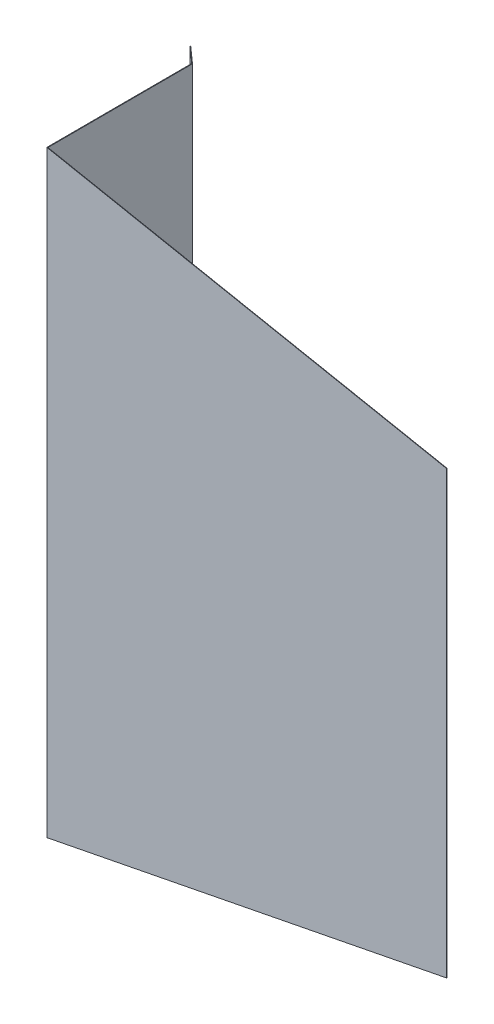
ISO-10303-21;
HEADER;
FILE_DESCRIPTION(('STEP AP214'),'2;1');
FILE_NAME('part.step','',(''),(''),'','','');
FILE_SCHEMA(('AUTOMOTIVE_DESIGN { 1 0 10303 214 1 1 1 1 }'));
ENDSEC;
DATA;
#1=APPLICATION_CONTEXT('core data for automotive mechanical design processes');
#2=APPLICATION_PROTOCOL_DEFINITION('international standard','automotive_design',2000,#1);
#3=PRODUCT_CONTEXT('',#1,'mechanical');
#4=PRODUCT('Part','Part','',(#3));
#5=PRODUCT_RELATED_PRODUCT_CATEGORY('part','',(#4));
#6=PRODUCT_DEFINITION_FORMATION('','',#4);
#7=PRODUCT_DEFINITION_CONTEXT('part definition',#1,'design');
#8=PRODUCT_DEFINITION('design','',#6,#7);
#9=PRODUCT_DEFINITION_SHAPE('','',#8);
#10=(LENGTH_UNIT() NAMED_UNIT(*) SI_UNIT(.MILLI.,.METRE.));
#11=(NAMED_UNIT(*) PLANE_ANGLE_UNIT() SI_UNIT($,.RADIAN.));
#12=(NAMED_UNIT(*) SI_UNIT($,.STERADIAN.) SOLID_ANGLE_UNIT());
#13=UNCERTAINTY_MEASURE_WITH_UNIT(LENGTH_MEASURE(1.E-05),#10,'distance_accuracy_value','');
#14=(GEOMETRIC_REPRESENTATION_CONTEXT(3) GLOBAL_UNCERTAINTY_ASSIGNED_CONTEXT((#13)) GLOBAL_UNIT_ASSIGNED_CONTEXT((#10,
#11,#12)) REPRESENTATION_CONTEXT('',''));
#15=CARTESIAN_POINT('',(0.,0.,0.));
#16=DIRECTION('',(0.,0.,1.));
#17=DIRECTION('',(1.,0.,0.));
#18=AXIS2_PLACEMENT_3D('',#15,#16,#17);
#19=CARTESIAN_POINT('',(970.078511470815,-400.,618.99934608897));
#20=DIRECTION('',(0.,0.,1.));
#21=DIRECTION('',(1.,0.,0.));
#22=AXIS2_PLACEMENT_3D('',#19,#20,#21);
#23=PLANE('',#22);
#24=DIRECTION('',(0.,1.,0.));
#25=VECTOR('',#24,1.);
#26=CARTESIAN_POINT('',(1360.07269303031,-400.,618.99934608897));
#27=LINE('',#26,#25);
#28=CARTESIAN_POINT('',(1360.07269303031,-215.463645069248,618.99934608897));
#29=VERTEX_POINT('',#28);
#30=CARTESIAN_POINT('',(1360.07269303031,215.463645069248,618.99934608897));
#31=VERTEX_POINT('',#30);
#32=EDGE_CURVE('E112',#29,#31,#27,.T.);
#33=ORIENTED_EDGE('',*,*,#32,.T.);
#34=DIRECTION('',(-0.981349358166264,0.192232768347809,0.));
#35=VECTOR('',#34,1.);
#36=CARTESIAN_POINT('',(1100.59581732235,266.291576757903,618.99934608897));
#37=LINE('',#36,#35);
#38=CARTESIAN_POINT('',(969.579172456127,291.955925679818,618.99934608897));
#39=VERTEX_POINT('',#38);
#40=EDGE_CURVE('E52',#31,#39,#37,.T.);
#41=ORIENTED_EDGE('',*,*,#40,.T.);
#42=DIRECTION('',(0.,1.,0.));
#43=VECTOR('',#42,1.);
#44=CARTESIAN_POINT('',(969.579172456127,-400.,618.99934608897));
#45=LINE('',#44,#43);
#46=CARTESIAN_POINT('',(969.579172456127,-291.955925679818,618.99934608897));
#47=VERTEX_POINT('',#46);
#48=EDGE_CURVE('E147',#47,#39,#45,.T.);
#49=ORIENTED_EDGE('',*,*,#48,.F.);
#50=DIRECTION('',(-0.981349358166264,-0.192232768347809,0.));
#51=VECTOR('',#50,1.);
#52=CARTESIAN_POINT('',(949.677814253037,-295.854326539233,618.99934608897));
#53=LINE('',#52,#51);
#54=EDGE_CURVE('E145',#29,#47,#53,.T.);
#55=ORIENTED_EDGE('',*,*,#54,.F.);
#56=EDGE_LOOP('',(#33,#41,#49,#55));
#57=FACE_BOUND('',#56,.T.);
#58=ADVANCED_FACE('F38',(#57),#23,.T.);
#59=CARTESIAN_POINT('',(969.391435085682,-400.,477.080007511184));
#60=DIRECTION('',(-0.999999125040928,0.,0.00132284442743429));
#61=DIRECTION('',(0.00132284442743429,0.,0.999999125040928));
#62=AXIS2_PLACEMENT_3D('',#59,#60,#61);
#63=PLANE('',#62);
#64=ORIENTED_EDGE('',*,*,#48,.T.);
#65=DIRECTION('',(-0.00132284438302193,0.000259126921239165,-0.999999091467576));
#66=VECTOR('',#65,1.);
#67=CARTESIAN_POINT('',(969.391672290118,291.992654369431,477.259321286359));
#68=LINE('',#67,#66);
#69=CARTESIAN_POINT('',(969.391736143137,291.992641861507,477.307590729229));
#70=VERTEX_POINT('',#69);
#71=EDGE_CURVE('E59',#39,#70,#68,.T.);
#72=ORIENTED_EDGE('',*,*,#71,.T.);
#73=DIRECTION('',(0.,1.,0.));
#74=VECTOR('',#73,1.);
#75=CARTESIAN_POINT('',(969.391736143137,-400.,477.307590729229));
#76=LINE('',#75,#74);
#77=CARTESIAN_POINT('',(969.391736143137,-291.992641861507,477.307590729229));
#78=VERTEX_POINT('',#77);
#79=EDGE_CURVE('E149',#78,#70,#76,.T.);
#80=ORIENTED_EDGE('',*,*,#79,.F.);
#81=DIRECTION('',(-0.00132284438302193,-0.000259126921239165,-0.999999091467576));
#82=VECTOR('',#81,1.);
#83=CARTESIAN_POINT('',(969.391398062444,-291.99270808684,477.052019937708));
#84=LINE('',#83,#82);
#85=EDGE_CURVE('E143',#47,#78,#84,.T.);
#86=ORIENTED_EDGE('',*,*,#85,.F.);
#87=EDGE_LOOP('',(#64,#72,#80,#86));
#88=FACE_BOUND('',#87,.T.);
#89=ADVANCED_FACE('F166',(#88),#63,.T.);
#90=CARTESIAN_POINT('',(956.328086186693,-400.,465.960617258553));
#91=DIRECTION('',(-0.655759950431802,0.,0.75496946124309));
#92=DIRECTION('',(0.75496946124309,0.,0.655759950431802));
#93=AXIS2_PLACEMENT_3D('',#90,#91,#92);
#94=PLANE('',#93);
#95=ORIENTED_EDGE('',*,*,#79,.T.);
#96=DIRECTION('',(-0.746846538137665,0.14629690880468,-0.648704449611671));
#97=VECTOR('',#96,1.);
#98=CARTESIAN_POINT('',(1032.21572792249,279.68629065446,531.875967133914));
#99=LINE('',#98,#97);
#100=CARTESIAN_POINT('',(956.328086186693,294.551630232934,465.960617258553));
#101=VERTEX_POINT('',#100);
#102=EDGE_CURVE('E129',#70,#101,#99,.T.);
#103=ORIENTED_EDGE('',*,*,#102,.T.);
#104=DIRECTION('',(0.,1.,0.));
#105=VECTOR('',#104,1.);
#106=CARTESIAN_POINT('',(956.328086186693,-400.,465.960617258553));
#107=LINE('',#106,#105);
#108=CARTESIAN_POINT('',(956.328086186693,-294.551630232933,465.960617258553));
#109=VERTEX_POINT('',#108);
#110=EDGE_CURVE('E151',#109,#101,#107,.T.);
#111=ORIENTED_EDGE('',*,*,#110,.F.);
#112=DIRECTION('',(-0.746846538137665,-0.14629690880468,-0.648704449611671));
#113=VECTOR('',#112,1.);
#114=CARTESIAN_POINT('',(944.806656017675,-296.808519075104,455.953202569091));
#115=LINE('',#114,#113);
#116=EDGE_CURVE('E141',#78,#109,#115,.T.);
#117=ORIENTED_EDGE('',*,*,#116,.F.);
#118=EDGE_LOOP('',(#95,#103,#111,#117));
#119=FACE_BOUND('',#118,.T.);
#120=ADVANCED_FACE('F168',(#119),#94,.T.);
#121=CARTESIAN_POINT('',(956.328086186693,-400.,465.960617258553));
#122=DIRECTION('',(0.754969461243108,0.,0.65575995043178));
#123=DIRECTION('',(0.65575995043178,0.,-0.754969461243108));
#124=AXIS2_PLACEMENT_3D('',#121,#122,#123);
#125=PLANE('',#124);
#126=DIRECTION('',(-0.650415809631713,0.127407462614861,0.748816808739738));
#127=VECTOR('',#126,1.);
#128=CARTESIAN_POINT('',(1013.88407118307,283.277208704282,399.697023461132));
#129=LINE('',#128,#127);
#130=CARTESIAN_POINT('',(956.655966161909,294.487403079986,465.583132527931));
#131=VERTEX_POINT('',#130);
#132=EDGE_CURVE('E172',#131,#101,#129,.T.);
#133=ORIENTED_EDGE('',*,*,#132,.F.);
#134=DIRECTION('',(0.,1.,0.));
#135=VECTOR('',#134,1.);
#136=CARTESIAN_POINT('',(956.655966161909,-400.,465.583132527931));
#137=LINE('',#136,#135);
#138=CARTESIAN_POINT('',(956.655966161909,-294.487403079986,465.583132527931));
#139=VERTEX_POINT('',#138);
#140=EDGE_CURVE('E154',#139,#131,#137,.T.);
#141=ORIENTED_EDGE('',*,*,#140,.F.);
#142=DIRECTION('',(-0.650415809631713,-0.127407462614861,0.748816808739738));
#143=VECTOR('',#142,1.);
#144=CARTESIAN_POINT('',(947.589808823252,-296.263337928248,476.020903113042));
#145=LINE('',#144,#143);
#146=EDGE_CURVE('E138',#139,#109,#145,.T.);
#147=ORIENTED_EDGE('',*,*,#146,.T.);
#148=ORIENTED_EDGE('',*,*,#110,.T.);
#149=EDGE_LOOP('',(#133,#141,#147,#148));
#150=FACE_BOUND('',#149,.T.);
#151=ADVANCED_FACE('F184',(#150),#125,.F.);
#152=CARTESIAN_POINT('',(956.655966161909,-400.,465.583132527931));
#153=DIRECTION('',(-0.655759950431802,0.,0.75496946124309));
#154=DIRECTION('',(0.75496946124309,0.,0.655759950431802));
#155=AXIS2_PLACEMENT_3D('',#152,#153,#154);
#156=PLANE('',#155);
#157=DIRECTION('',(-0.746846538137665,0.14629690880468,-0.648704449611671));
#158=VECTOR('',#157,1.);
#159=CARTESIAN_POINT('',(1032.53659035292,279.623438141492,531.492387024528));
#160=LINE('',#159,#158);
#161=CARTESIAN_POINT('',(969.891434648202,291.894757834612,477.079346088971));
#162=VERTEX_POINT('',#161);
#163=EDGE_CURVE('E173',#162,#131,#160,.T.);
#164=ORIENTED_EDGE('',*,*,#163,.F.);
#165=DIRECTION('',(0.,1.,0.));
#166=VECTOR('',#165,1.);
#167=CARTESIAN_POINT('',(969.891434648202,-400.,477.079346088971));
#168=LINE('',#167,#166);
#169=CARTESIAN_POINT('',(969.891434648202,-291.894757834613,477.079346088971));
#170=VERTEX_POINT('',#169);
#171=EDGE_CURVE('E157',#170,#162,#168,.T.);
#172=ORIENTED_EDGE('',*,*,#171,.F.);
#173=DIRECTION('',(-0.746846538137665,-0.14629690880468,-0.648704449611671));
#174=VECTOR('',#173,1.);
#175=CARTESIAN_POINT('',(945.127518448103,-296.745666562136,455.569622459705));
#176=LINE('',#175,#174);
#177=EDGE_CURVE('E135',#170,#139,#176,.T.);
#178=ORIENTED_EDGE('',*,*,#177,.T.);
#179=ORIENTED_EDGE('',*,*,#140,.T.);
#180=EDGE_LOOP('',(#164,#172,#178,#179));
#181=FACE_BOUND('',#180,.T.);
#182=ADVANCED_FACE('F181',(#181),#156,.F.);
#183=CARTESIAN_POINT('',(969.891434648202,-400.,477.079346088971));
#184=DIRECTION('',(-0.999999125040928,0.,0.00132284442743429));
#185=DIRECTION('',(0.00132284442743429,0.,0.999999125040928));
#186=AXIS2_PLACEMENT_3D('',#183,#184,#185);
#187=PLANE('',#186);
#188=DIRECTION('',(-0.00132284438302193,0.000259126921239165,-0.999999091467576));
#189=VECTOR('',#188,1.);
#190=CARTESIAN_POINT('',(969.891671819065,291.89471137612,477.2586344845));
#191=LINE('',#190,#189);
#192=CARTESIAN_POINT('',(970.078511470815,291.858112072117,618.49934608897));
#193=VERTEX_POINT('',#192);
#194=EDGE_CURVE('E121',#193,#162,#191,.T.);
#195=ORIENTED_EDGE('',*,*,#194,.F.);
#196=DIRECTION('',(0.,1.,0.));
#197=VECTOR('',#196,1.);
#198=CARTESIAN_POINT('',(970.078511470815,-400.,618.49934608897));
#199=LINE('',#198,#197);
#200=CARTESIAN_POINT('',(970.078511470815,-291.858112072117,618.49934608897));
#201=VERTEX_POINT('',#200);
#202=EDGE_CURVE('E111',#201,#193,#199,.T.);
#203=ORIENTED_EDGE('',*,*,#202,.F.);
#204=DIRECTION('',(-0.00132284438302193,-0.000259126921239165,-0.999999091467576));
#205=VECTOR('',#204,1.);
#206=CARTESIAN_POINT('',(969.891397591391,-291.89476509353,477.051333135849));
#207=LINE('',#206,#205);
#208=EDGE_CURVE('E127',#201,#170,#207,.T.);
#209=ORIENTED_EDGE('',*,*,#208,.T.);
#210=ORIENTED_EDGE('',*,*,#171,.T.);
#211=EDGE_LOOP('',(#195,#203,#209,#210));
#212=FACE_BOUND('',#211,.T.);
#213=ADVANCED_FACE('F178',(#212),#187,.F.);
#214=CARTESIAN_POINT('',(970.078511470815,-400.,618.49934608897));
#215=DIRECTION('',(0.,0.,1.));
#216=DIRECTION('',(1.,0.,0.));
#217=AXIS2_PLACEMENT_3D('',#214,#215,#216);
#218=PLANE('',#217);
#219=DIRECTION('',(-0.981349358166264,0.192232768347809,0.));
#220=VECTOR('',#219,1.);
#221=CARTESIAN_POINT('',(1100.59581732235,266.291576757903,618.49934608897));
#222=LINE('',#221,#220);
#223=CARTESIAN_POINT('',(1360.07269303031,215.463645069248,618.49934608897));
#224=VERTEX_POINT('',#223);
#225=EDGE_CURVE('E116',#224,#193,#222,.T.);
#226=ORIENTED_EDGE('',*,*,#225,.F.);
#227=DIRECTION('',(0.,1.,0.));
#228=VECTOR('',#227,1.);
#229=CARTESIAN_POINT('',(1360.07269303031,-400.,618.49934608897));
#230=LINE('',#229,#228);
#231=CARTESIAN_POINT('',(1360.07269303031,-215.463645069248,618.49934608897));
#232=VERTEX_POINT('',#231);
#233=EDGE_CURVE('E105',#232,#224,#230,.T.);
#234=ORIENTED_EDGE('',*,*,#233,.F.);
#235=DIRECTION('',(-0.981349358166264,-0.192232768347809,0.));
#236=VECTOR('',#235,1.);
#237=CARTESIAN_POINT('',(949.677814253037,-295.854326539233,618.49934608897));
#238=LINE('',#237,#236);
#239=EDGE_CURVE('E125',#232,#201,#238,.T.);
#240=ORIENTED_EDGE('',*,*,#239,.T.);
#241=ORIENTED_EDGE('',*,*,#202,.T.);
#242=EDGE_LOOP('',(#226,#234,#240,#241));
#243=FACE_BOUND('',#242,.T.);
#244=ADVANCED_FACE('F117',(#243),#218,.F.);
#245=CARTESIAN_POINT('',(1360.07269303031,-400.,618.49934608897));
#246=DIRECTION('',(-1.,0.,0.));
#247=DIRECTION('',(0.,0.,1.));
#248=AXIS2_PLACEMENT_3D('',#245,#246,#247);
#249=PLANE('',#248);
#250=DIRECTION('',(0.,0.,-1.));
#251=VECTOR('',#250,1.);
#252=CARTESIAN_POINT('',(1360.07269303031,215.463645069248,618.49934608897));
#253=LINE('',#252,#251);
#254=EDGE_CURVE('E12',#31,#224,#253,.T.);
#255=ORIENTED_EDGE('',*,*,#254,.F.);
#256=ORIENTED_EDGE('',*,*,#32,.F.);
#257=DIRECTION('',(0.,0.,-1.));
#258=VECTOR('',#257,1.);
#259=CARTESIAN_POINT('',(1360.07269303031,-215.463645069248,618.49934608897));
#260=LINE('',#259,#258);
#261=EDGE_CURVE('E45',#29,#232,#260,.T.);
#262=ORIENTED_EDGE('',*,*,#261,.T.);
#263=ORIENTED_EDGE('',*,*,#233,.T.);
#264=EDGE_LOOP('',(#255,#256,#262,#263));
#265=FACE_BOUND('',#264,.T.);
#266=ADVANCED_FACE('F107',(#265),#249,.F.);
#267=CARTESIAN_POINT('',(90.9060396954521,-464.075841363107,0.));
#268=DIRECTION('',(-0.192232768347809,0.981349358166264,0.));
#269=DIRECTION('',(-0.981349358166264,-0.192232768347809,0.));
#270=AXIS2_PLACEMENT_3D('',#267,#268,#269);
#271=PLANE('',#270);
#272=ORIENTED_EDGE('',*,*,#261,.F.);
#273=ORIENTED_EDGE('',*,*,#54,.T.);
#274=ORIENTED_EDGE('',*,*,#85,.T.);
#275=ORIENTED_EDGE('',*,*,#116,.T.);
#276=ORIENTED_EDGE('',*,*,#146,.F.);
#277=ORIENTED_EDGE('',*,*,#177,.F.);
#278=ORIENTED_EDGE('',*,*,#208,.F.);
#279=ORIENTED_EDGE('',*,*,#239,.F.);
#280=EDGE_LOOP('',(#272,#273,#274,#275,#276,#277,#278,#279));
#281=FACE_BOUND('',#280,.T.);
#282=ADVANCED_FACE('F164',(#281),#271,.F.);
#283=CARTESIAN_POINT('',(90.9060396954521,464.075841363107,0.));
#284=DIRECTION('',(0.192232768347809,0.981349358166264,0.));
#285=DIRECTION('',(-0.981349358166264,0.192232768347809,0.));
#286=AXIS2_PLACEMENT_3D('',#283,#284,#285);
#287=PLANE('',#286);
#288=ORIENTED_EDGE('',*,*,#40,.F.);
#289=ORIENTED_EDGE('',*,*,#254,.T.);
#290=ORIENTED_EDGE('',*,*,#225,.T.);
#291=ORIENTED_EDGE('',*,*,#194,.T.);
#292=ORIENTED_EDGE('',*,*,#163,.T.);
#293=ORIENTED_EDGE('',*,*,#132,.T.);
#294=ORIENTED_EDGE('',*,*,#102,.F.);
#295=ORIENTED_EDGE('',*,*,#71,.F.);
#296=EDGE_LOOP('',(#288,#289,#290,#291,#292,#293,#294,#295));
#297=FACE_BOUND('',#296,.T.);
#298=ADVANCED_FACE('F123',(#297),#287,.T.);
#299=CLOSED_SHELL('',(#58,#89,#120,#151,#182,#213,#244,#266,#282,#298));
#300=MANIFOLD_SOLID_BREP('B2',#299);
#301=ADVANCED_BREP_SHAPE_REPRESENTATION('',(#18,#300),#14);
#302=SHAPE_DEFINITION_REPRESENTATION(#9,#301);
ENDSEC;
END-ISO-10303-21;
